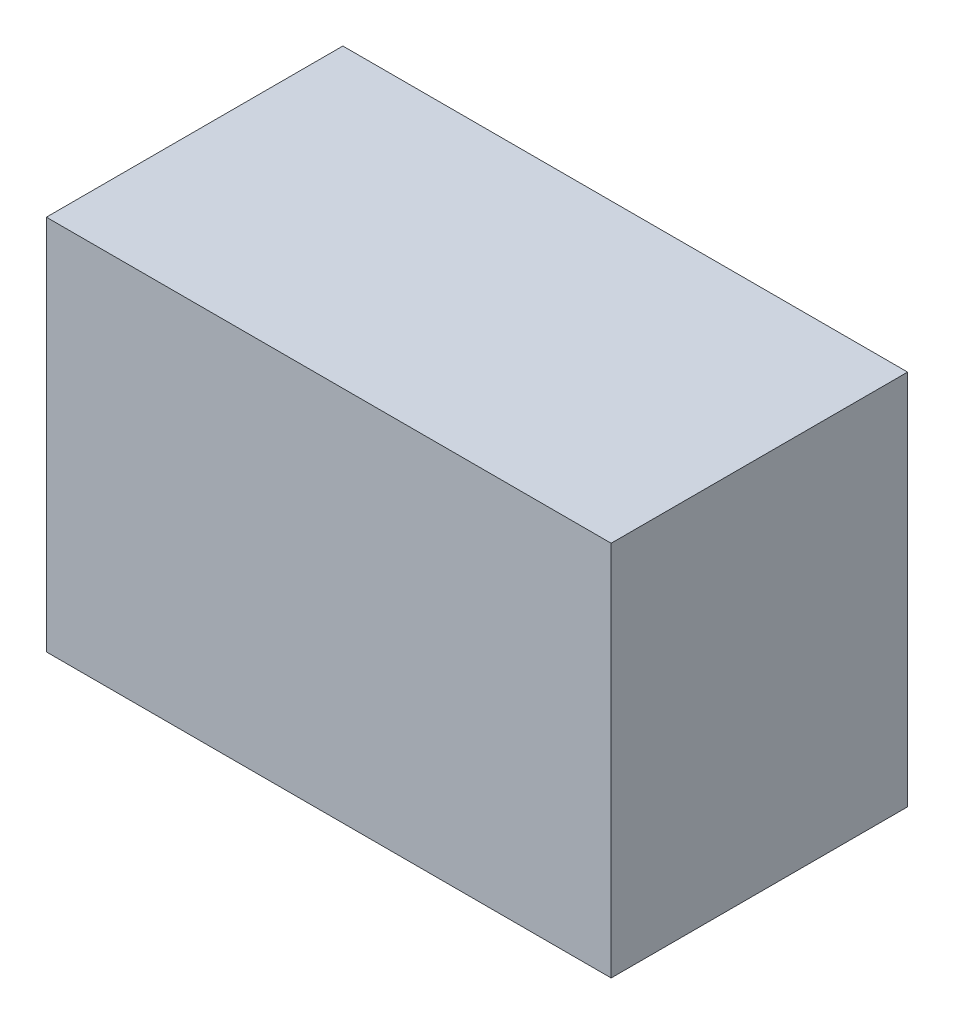
ISO-10303-21;
HEADER;
FILE_DESCRIPTION(('STEP AP214'),'2;1');
FILE_NAME('part.step','',(''),(''),'','','');
FILE_SCHEMA(('AUTOMOTIVE_DESIGN { 1 0 10303 214 1 1 1 1 }'));
ENDSEC;
DATA;
#1=APPLICATION_CONTEXT('core data for automotive mechanical design processes');
#2=APPLICATION_PROTOCOL_DEFINITION('international standard','automotive_design',2000,#1);
#3=PRODUCT_CONTEXT('',#1,'mechanical');
#4=PRODUCT('Part','Part','',(#3));
#5=PRODUCT_RELATED_PRODUCT_CATEGORY('part','',(#4));
#6=PRODUCT_DEFINITION_FORMATION('','',#4);
#7=PRODUCT_DEFINITION_CONTEXT('part definition',#1,'design');
#8=PRODUCT_DEFINITION('design','',#6,#7);
#9=PRODUCT_DEFINITION_SHAPE('','',#8);
#10=(LENGTH_UNIT() NAMED_UNIT(*) SI_UNIT(.MILLI.,.METRE.));
#11=(NAMED_UNIT(*) PLANE_ANGLE_UNIT() SI_UNIT($,.RADIAN.));
#12=(NAMED_UNIT(*) SI_UNIT($,.STERADIAN.) SOLID_ANGLE_UNIT());
#13=UNCERTAINTY_MEASURE_WITH_UNIT(LENGTH_MEASURE(1.E-05),#10,'distance_accuracy_value','');
#14=(GEOMETRIC_REPRESENTATION_CONTEXT(3) GLOBAL_UNCERTAINTY_ASSIGNED_CONTEXT((#13)) GLOBAL_UNIT_ASSIGNED_CONTEXT((#10,
#11,#12)) REPRESENTATION_CONTEXT('',''));
#15=CARTESIAN_POINT('',(0.,0.,0.));
#16=DIRECTION('',(0.,0.,1.));
#17=DIRECTION('',(1.,0.,0.));
#18=AXIS2_PLACEMENT_3D('',#15,#16,#17);
#19=CARTESIAN_POINT('',(-1.143,-0.762,1.20000014));
#20=DIRECTION('',(0.,0.,1.));
#21=DIRECTION('',(1.,0.,0.));
#22=AXIS2_PLACEMENT_3D('',#19,#20,#21);
#23=PLANE('',#22);
#24=DIRECTION('',(1.,0.,0.));
#25=VECTOR('',#24,1.);
#26=CARTESIAN_POINT('',(-1.143,0.762,1.20000014));
#27=LINE('',#26,#25);
#28=CARTESIAN_POINT('',(-1.143,0.762,1.20000014));
#29=VERTEX_POINT('',#28);
#30=CARTESIAN_POINT('',(1.143,0.762,1.20000014));
#31=VERTEX_POINT('',#30);
#32=EDGE_CURVE('E53',#29,#31,#27,.T.);
#33=ORIENTED_EDGE('',*,*,#32,.F.);
#34=DIRECTION('',(0.,1.,0.));
#35=VECTOR('',#34,1.);
#36=CARTESIAN_POINT('',(-1.143,-0.762,1.20000014));
#37=LINE('',#36,#35);
#38=CARTESIAN_POINT('',(-1.143,-0.762,1.20000014));
#39=VERTEX_POINT('',#38);
#40=EDGE_CURVE('E20',#29,#39,#37,.F.);
#41=ORIENTED_EDGE('',*,*,#40,.T.);
#42=DIRECTION('',(1.,0.,0.));
#43=VECTOR('',#42,1.);
#44=CARTESIAN_POINT('',(1.143,-0.762,1.20000014));
#45=LINE('',#44,#43);
#46=CARTESIAN_POINT('',(1.143,-0.762,1.20000014));
#47=VERTEX_POINT('',#46);
#48=EDGE_CURVE('E67',#47,#39,#45,.F.);
#49=ORIENTED_EDGE('',*,*,#48,.F.);
#50=DIRECTION('',(0.,1.,0.));
#51=VECTOR('',#50,1.);
#52=CARTESIAN_POINT('',(1.143,0.762,1.20000014));
#53=LINE('',#52,#51);
#54=EDGE_CURVE('E58',#31,#47,#53,.F.);
#55=ORIENTED_EDGE('',*,*,#54,.F.);
#56=EDGE_LOOP('',(#33,#41,#49,#55));
#57=FACE_BOUND('',#56,.T.);
#58=ADVANCED_FACE('F17',(#57),#23,.T.);
#59=CARTESIAN_POINT('',(1.143,-0.762,0.));
#60=DIRECTION('',(0.,-1.,0.));
#61=DIRECTION('',(0.,0.,-1.));
#62=AXIS2_PLACEMENT_3D('',#59,#60,#61);
#63=PLANE('',#62);
#64=DIRECTION('',(0.,0.,1.));
#65=VECTOR('',#64,1.);
#66=CARTESIAN_POINT('',(-1.143,-0.762,0.));
#67=LINE('',#66,#65);
#68=CARTESIAN_POINT('',(-1.143,-0.762,0.));
#69=VERTEX_POINT('',#68);
#70=EDGE_CURVE('E80',#69,#39,#67,.T.);
#71=ORIENTED_EDGE('',*,*,#70,.F.);
#72=DIRECTION('',(1.,0.,0.));
#73=VECTOR('',#72,1.);
#74=CARTESIAN_POINT('',(-1.143,-0.762,0.));
#75=LINE('',#74,#73);
#76=CARTESIAN_POINT('',(1.143,-0.762,0.));
#77=VERTEX_POINT('',#76);
#78=EDGE_CURVE('E75',#69,#77,#75,.T.);
#79=ORIENTED_EDGE('',*,*,#78,.T.);
#80=DIRECTION('',(0.,0.,-1.));
#81=VECTOR('',#80,1.);
#82=CARTESIAN_POINT('',(1.143,-0.762,0.));
#83=LINE('',#82,#81);
#84=EDGE_CURVE('E63',#47,#77,#83,.T.);
#85=ORIENTED_EDGE('',*,*,#84,.F.);
#86=ORIENTED_EDGE('',*,*,#48,.T.);
#87=EDGE_LOOP('',(#71,#79,#85,#86));
#88=FACE_BOUND('',#87,.T.);
#89=ADVANCED_FACE('F74',(#88),#63,.T.);
#90=CARTESIAN_POINT('',(1.143,0.762,0.));
#91=DIRECTION('',(1.,0.,0.));
#92=DIRECTION('',(0.,0.,-1.));
#93=AXIS2_PLACEMENT_3D('',#90,#91,#92);
#94=PLANE('',#93);
#95=ORIENTED_EDGE('',*,*,#84,.T.);
#96=DIRECTION('',(0.,1.,0.));
#97=VECTOR('',#96,1.);
#98=CARTESIAN_POINT('',(1.143,-0.762,0.));
#99=LINE('',#98,#97);
#100=CARTESIAN_POINT('',(1.143,0.762,0.));
#101=VERTEX_POINT('',#100);
#102=EDGE_CURVE('E84',#77,#101,#99,.T.);
#103=ORIENTED_EDGE('',*,*,#102,.T.);
#104=DIRECTION('',(0.,0.,1.));
#105=VECTOR('',#104,1.);
#106=CARTESIAN_POINT('',(1.143,0.762,0.));
#107=LINE('',#106,#105);
#108=EDGE_CURVE('E65',#31,#101,#107,.F.);
#109=ORIENTED_EDGE('',*,*,#108,.F.);
#110=ORIENTED_EDGE('',*,*,#54,.T.);
#111=EDGE_LOOP('',(#95,#103,#109,#110));
#112=FACE_BOUND('',#111,.T.);
#113=ADVANCED_FACE('F60',(#112),#94,.T.);
#114=CARTESIAN_POINT('',(-1.143,0.762,0.));
#115=DIRECTION('',(0.,1.,0.));
#116=DIRECTION('',(0.,0.,1.));
#117=AXIS2_PLACEMENT_3D('',#114,#115,#116);
#118=PLANE('',#117);
#119=ORIENTED_EDGE('',*,*,#108,.T.);
#120=DIRECTION('',(1.,0.,0.));
#121=VECTOR('',#120,1.);
#122=CARTESIAN_POINT('',(-1.143,0.762,0.));
#123=LINE('',#122,#121);
#124=CARTESIAN_POINT('',(-1.143,0.762,0.));
#125=VERTEX_POINT('',#124);
#126=EDGE_CURVE('E26',#101,#125,#123,.F.);
#127=ORIENTED_EDGE('',*,*,#126,.T.);
#128=DIRECTION('',(0.,0.,1.));
#129=VECTOR('',#128,1.);
#130=CARTESIAN_POINT('',(-1.143,0.762,0.));
#131=LINE('',#130,#129);
#132=EDGE_CURVE('E34',#29,#125,#131,.F.);
#133=ORIENTED_EDGE('',*,*,#132,.F.);
#134=ORIENTED_EDGE('',*,*,#32,.T.);
#135=EDGE_LOOP('',(#119,#127,#133,#134));
#136=FACE_BOUND('',#135,.T.);
#137=ADVANCED_FACE('F88',(#136),#118,.T.);
#138=CARTESIAN_POINT('',(-1.143,-0.762,0.));
#139=DIRECTION('',(-1.,0.,0.));
#140=DIRECTION('',(0.,0.,1.));
#141=AXIS2_PLACEMENT_3D('',#138,#139,#140);
#142=PLANE('',#141);
#143=ORIENTED_EDGE('',*,*,#132,.T.);
#144=DIRECTION('',(0.,1.,0.));
#145=VECTOR('',#144,1.);
#146=CARTESIAN_POINT('',(-1.143,-0.762,0.));
#147=LINE('',#146,#145);
#148=EDGE_CURVE('E11',#125,#69,#147,.F.);
#149=ORIENTED_EDGE('',*,*,#148,.T.);
#150=ORIENTED_EDGE('',*,*,#70,.T.);
#151=ORIENTED_EDGE('',*,*,#40,.F.);
#152=EDGE_LOOP('',(#143,#149,#150,#151));
#153=FACE_BOUND('',#152,.T.);
#154=ADVANCED_FACE('F91',(#153),#142,.T.);
#155=CARTESIAN_POINT('',(-1.143,-0.762,0.));
#156=DIRECTION('',(0.,0.,1.));
#157=DIRECTION('',(1.,0.,0.));
#158=AXIS2_PLACEMENT_3D('',#155,#156,#157);
#159=PLANE('',#158);
#160=ORIENTED_EDGE('',*,*,#126,.F.);
#161=ORIENTED_EDGE('',*,*,#102,.F.);
#162=ORIENTED_EDGE('',*,*,#78,.F.);
#163=ORIENTED_EDGE('',*,*,#148,.F.);
#164=EDGE_LOOP('',(#160,#161,#162,#163));
#165=FACE_BOUND('',#164,.T.);
#166=ADVANCED_FACE('F90',(#165),#159,.F.);
#167=CLOSED_SHELL('',(#58,#89,#113,#137,#154,#166));
#168=MANIFOLD_SOLID_BREP('B1',#167);
#169=ADVANCED_BREP_SHAPE_REPRESENTATION('',(#18,#168),#14);
#170=SHAPE_DEFINITION_REPRESENTATION(#9,#169);
ENDSEC;
END-ISO-10303-21;
